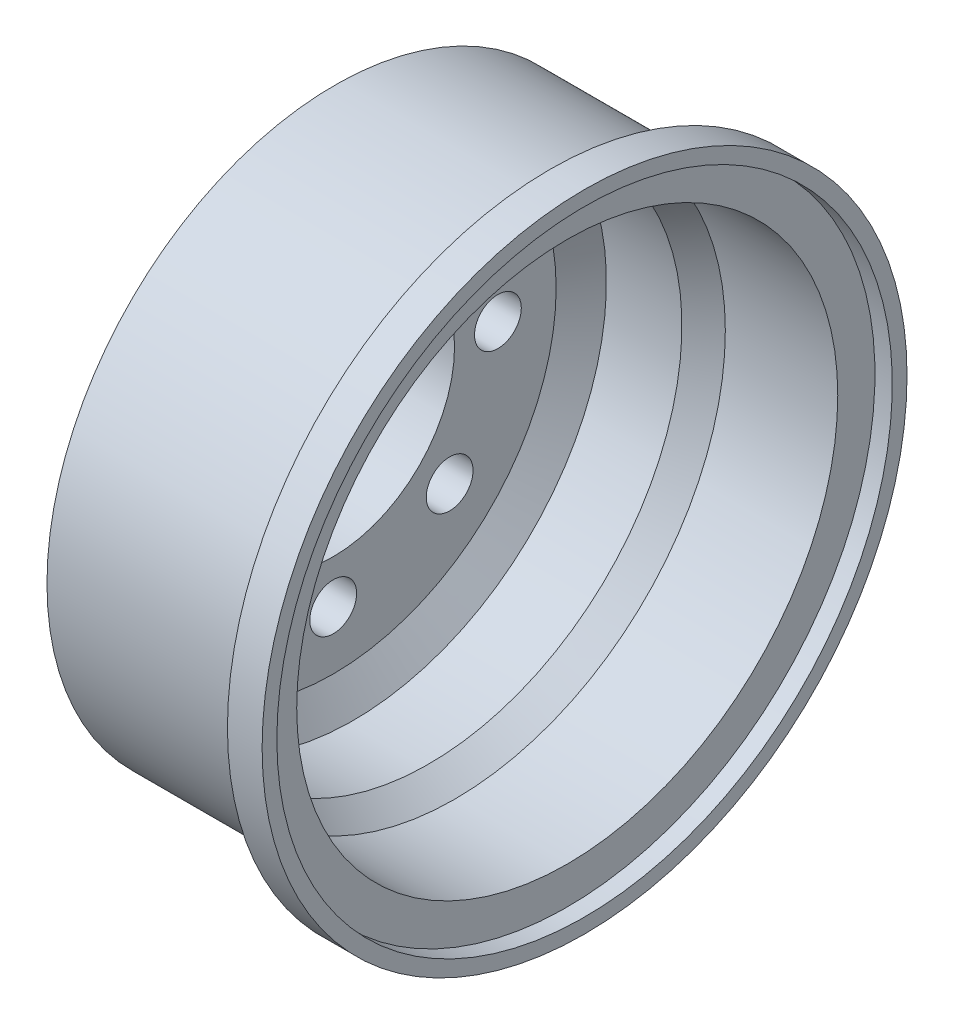
ISO-10303-21;
HEADER;
FILE_DESCRIPTION(('STEP AP214'),'2;1');
FILE_NAME('part.step','',(''),(''),'','','');
FILE_SCHEMA(('AUTOMOTIVE_DESIGN { 1 0 10303 214 1 1 1 1 }'));
ENDSEC;
DATA;
#1=APPLICATION_CONTEXT('core data for automotive mechanical design processes');
#2=APPLICATION_PROTOCOL_DEFINITION('international standard','automotive_design',2000,#1);
#3=PRODUCT_CONTEXT('',#1,'mechanical');
#4=PRODUCT('Part','Part','',(#3));
#5=PRODUCT_RELATED_PRODUCT_CATEGORY('part','',(#4));
#6=PRODUCT_DEFINITION_FORMATION('','',#4);
#7=PRODUCT_DEFINITION_CONTEXT('part definition',#1,'design');
#8=PRODUCT_DEFINITION('design','',#6,#7);
#9=PRODUCT_DEFINITION_SHAPE('','',#8);
#10=(LENGTH_UNIT() NAMED_UNIT(*) SI_UNIT(.MILLI.,.METRE.));
#11=(NAMED_UNIT(*) PLANE_ANGLE_UNIT() SI_UNIT($,.RADIAN.));
#12=(NAMED_UNIT(*) SI_UNIT($,.STERADIAN.) SOLID_ANGLE_UNIT());
#13=UNCERTAINTY_MEASURE_WITH_UNIT(LENGTH_MEASURE(1.E-05),#10,'distance_accuracy_value','');
#14=(GEOMETRIC_REPRESENTATION_CONTEXT(3) GLOBAL_UNCERTAINTY_ASSIGNED_CONTEXT((#13)) GLOBAL_UNIT_ASSIGNED_CONTEXT((#10,
#11,#12)) REPRESENTATION_CONTEXT('',''));
#15=CARTESIAN_POINT('',(0.,0.,0.));
#16=DIRECTION('',(0.,0.,1.));
#17=DIRECTION('',(1.,0.,0.));
#18=AXIS2_PLACEMENT_3D('',#15,#16,#17);
#19=CARTESIAN_POINT('',(2.71561884584929,0.,0.));
#20=DIRECTION('',(1.,0.,0.));
#21=DIRECTION('',(0.,0.,-1.));
#22=AXIS2_PLACEMENT_3D('',#19,#20,#21);
#23=CONICAL_SURFACE('',#22,14.6,0.590123359638332);
#24=CARTESIAN_POINT('',(4.21561884584929,0.,0.));
#25=DIRECTION('',(-1.,0.,0.));
#26=DIRECTION('',(0.,0.,1.));
#27=AXIS2_PLACEMENT_3D('',#24,#25,#26);
#28=CIRCLE('',#27,15.6046014841789);
#29=CARTESIAN_POINT('',(4.21561884584929,0.,15.6046014841789));
#30=VERTEX_POINT('',#29);
#31=EDGE_CURVE('E70',#30,#30,#28,.T.);
#32=ORIENTED_EDGE('',*,*,#31,.F.);
#33=EDGE_LOOP('',(#32));
#34=FACE_BOUND('',#33,.T.);
#35=CARTESIAN_POINT('',(2.71561884584929,0.,0.));
#36=DIRECTION('',(-1.,0.,0.));
#37=DIRECTION('',(0.,0.,1.));
#38=AXIS2_PLACEMENT_3D('',#35,#36,#37);
#39=CIRCLE('',#38,14.6);
#40=CARTESIAN_POINT('',(2.71561884584929,0.,14.6));
#41=VERTEX_POINT('',#40);
#42=EDGE_CURVE('E10',#41,#41,#39,.T.);
#43=ORIENTED_EDGE('',*,*,#42,.T.);
#44=EDGE_LOOP('',(#43));
#45=FACE_BOUND('',#44,.T.);
#46=ADVANCED_FACE('F31',(#34,#45),#23,.F.);
#47=CARTESIAN_POINT('',(-25.,0.,0.));
#48=DIRECTION('',(-1.,0.,0.));
#49=DIRECTION('',(0.,0.,1.));
#50=AXIS2_PLACEMENT_3D('',#47,#48,#49);
#51=CYLINDRICAL_SURFACE('',#50,14.6);
#52=ORIENTED_EDGE('',*,*,#42,.F.);
#53=EDGE_LOOP('',(#52));
#54=FACE_BOUND('',#53,.T.);
#55=CARTESIAN_POINT('',(-1.63826352647171,0.,0.));
#56=DIRECTION('',(-1.,0.,0.));
#57=DIRECTION('',(0.,0.,1.));
#58=AXIS2_PLACEMENT_3D('',#55,#56,#57);
#59=CIRCLE('',#58,14.6);
#60=CARTESIAN_POINT('',(-1.63826352647171,0.,14.6));
#61=VERTEX_POINT('',#60);
#62=EDGE_CURVE('E38',#61,#61,#59,.T.);
#63=ORIENTED_EDGE('',*,*,#62,.T.);
#64=EDGE_LOOP('',(#63));
#65=FACE_BOUND('',#64,.T.);
#66=ADVANCED_FACE('F187',(#54,#65),#51,.F.);
#67=CARTESIAN_POINT('',(-2.79809650389222,0.,0.));
#68=DIRECTION('',(1.,0.,0.));
#69=DIRECTION('',(0.,0.,-1.));
#70=AXIS2_PLACEMENT_3D('',#67,#68,#69);
#71=CONICAL_SURFACE('',#70,12.8602505338692,0.982793723247329);
#72=ORIENTED_EDGE('',*,*,#62,.F.);
#73=EDGE_LOOP('',(#72));
#74=FACE_BOUND('',#73,.T.);
#75=CARTESIAN_POINT('',(-2.79809650389222,0.,0.));
#76=DIRECTION('',(-1.,0.,0.));
#77=DIRECTION('',(0.,0.,1.));
#78=AXIS2_PLACEMENT_3D('',#75,#76,#77);
#79=CIRCLE('',#78,12.8602505338692);
#80=CARTESIAN_POINT('',(-2.79809650389222,0.,12.8602505338692));
#81=VERTEX_POINT('',#80);
#82=EDGE_CURVE('E43',#81,#81,#79,.T.);
#83=ORIENTED_EDGE('',*,*,#82,.T.);
#84=EDGE_LOOP('',(#83));
#85=FACE_BOUND('',#84,.T.);
#86=ADVANCED_FACE('F113',(#74,#85),#71,.F.);
#87=CARTESIAN_POINT('',(-2.79809650389222,12.8602505338692,0.));
#88=DIRECTION('',(-1.,0.,0.));
#89=DIRECTION('',(0.,0.,1.));
#90=AXIS2_PLACEMENT_3D('',#87,#88,#89);
#91=PLANE('',#90);
#92=CARTESIAN_POINT('',(-2.79809650389222,9.5,0.));
#93=DIRECTION('',(1.,0.,0.));
#94=DIRECTION('',(0.,0.,-1.));
#95=AXIS2_PLACEMENT_3D('',#92,#93,#94);
#96=CIRCLE('',#95,1.35);
#97=CARTESIAN_POINT('',(-2.79809650389222,9.5,-1.35));
#98=VERTEX_POINT('',#97);
#99=EDGE_CURVE('E51',#98,#98,#96,.T.);
#100=ORIENTED_EDGE('',*,*,#99,.F.);
#101=EDGE_LOOP('',(#100));
#102=FACE_BOUND('',#101,.T.);
#103=CARTESIAN_POINT('',(-2.79809650389222,6.71751442127219,-6.71751442127221));
#104=DIRECTION('',(1.,0.,0.));
#105=DIRECTION('',(0.,0.,-1.));
#106=AXIS2_PLACEMENT_3D('',#103,#104,#105);
#107=CIRCLE('',#106,1.35);
#108=CARTESIAN_POINT('',(-2.79809650389222,6.71751442127219,-8.06751442127221));
#109=VERTEX_POINT('',#108);
#110=EDGE_CURVE('E328',#109,#109,#107,.T.);
#111=ORIENTED_EDGE('',*,*,#110,.F.);
#112=EDGE_LOOP('',(#111));
#113=FACE_BOUND('',#112,.T.);
#114=CARTESIAN_POINT('',(-2.79809650389222,2.68261117900053E-13,-9.50000000000027));
#115=DIRECTION('',(1.,0.,0.));
#116=DIRECTION('',(0.,0.,-1.));
#117=AXIS2_PLACEMENT_3D('',#114,#115,#116);
#118=CIRCLE('',#117,1.35);
#119=CARTESIAN_POINT('',(-2.79809650389222,2.68261117900053E-13,-10.8500000000003));
#120=VERTEX_POINT('',#119);
#121=EDGE_CURVE('E331',#120,#120,#118,.T.);
#122=ORIENTED_EDGE('',*,*,#121,.F.);
#123=EDGE_LOOP('',(#122));
#124=FACE_BOUND('',#123,.T.);
#125=CARTESIAN_POINT('',(-2.79809650389222,-6.71751442127201,-6.71751442127266));
#126=DIRECTION('',(1.,0.,0.));
#127=DIRECTION('',(0.,0.,-1.));
#128=AXIS2_PLACEMENT_3D('',#125,#126,#127);
#129=CIRCLE('',#128,1.35);
#130=CARTESIAN_POINT('',(-2.79809650389222,-6.71751442127201,-8.06751442127266));
#131=VERTEX_POINT('',#130);
#132=EDGE_CURVE('E336',#131,#131,#129,.T.);
#133=ORIENTED_EDGE('',*,*,#132,.F.);
#134=EDGE_LOOP('',(#133));
#135=FACE_BOUND('',#134,.T.);
#136=CARTESIAN_POINT('',(-2.79809650389222,-9.5,-5.36522235800106E-13));
#137=DIRECTION('',(1.,0.,0.));
#138=DIRECTION('',(0.,0.,-1.));
#139=AXIS2_PLACEMENT_3D('',#136,#137,#138);
#140=CIRCLE('',#139,1.35);
#141=CARTESIAN_POINT('',(-2.79809650389222,-9.5,-1.35000000000054));
#142=VERTEX_POINT('',#141);
#143=EDGE_CURVE('E339',#142,#142,#140,.T.);
#144=ORIENTED_EDGE('',*,*,#143,.F.);
#145=EDGE_LOOP('',(#144));
#146=FACE_BOUND('',#145,.T.);
#147=CARTESIAN_POINT('',(-2.79809650389222,-6.71751442127239,6.71751442127174));
#148=DIRECTION('',(1.,0.,0.));
#149=DIRECTION('',(0.,0.,-1.));
#150=AXIS2_PLACEMENT_3D('',#147,#148,#149);
#151=CIRCLE('',#150,1.35);
#152=CARTESIAN_POINT('',(-2.79809650389222,-6.71751442127239,5.36751442127174));
#153=VERTEX_POINT('',#152);
#154=EDGE_CURVE('E342',#153,#153,#151,.T.);
#155=ORIENTED_EDGE('',*,*,#154,.F.);
#156=EDGE_LOOP('',(#155));
#157=FACE_BOUND('',#156,.T.);
#158=CARTESIAN_POINT('',(-2.79809650389222,-2.69424532359243E-13,9.49999999999973));
#159=DIRECTION('',(1.,0.,0.));
#160=DIRECTION('',(0.,0.,-1.));
#161=AXIS2_PLACEMENT_3D('',#158,#159,#160);
#162=CIRCLE('',#161,1.35);
#163=CARTESIAN_POINT('',(-2.79809650389222,-2.69424532359243E-13,8.14999999999973));
#164=VERTEX_POINT('',#163);
#165=EDGE_CURVE('E344',#164,#164,#162,.T.);
#166=ORIENTED_EDGE('',*,*,#165,.F.);
#167=EDGE_LOOP('',(#166));
#168=FACE_BOUND('',#167,.T.);
#169=CARTESIAN_POINT('',(-2.79809650389222,6.71751442127201,6.71751442127213));
#170=DIRECTION('',(1.,0.,0.));
#171=DIRECTION('',(0.,0.,-1.));
#172=AXIS2_PLACEMENT_3D('',#169,#170,#171);
#173=CIRCLE('',#172,1.35);
#174=CARTESIAN_POINT('',(-2.79809650389222,6.71751442127201,5.36751442127213));
#175=VERTEX_POINT('',#174);
#176=EDGE_CURVE('E82',#175,#175,#173,.T.);
#177=ORIENTED_EDGE('',*,*,#176,.F.);
#178=EDGE_LOOP('',(#177));
#179=FACE_BOUND('',#178,.T.);
#180=ORIENTED_EDGE('',*,*,#82,.F.);
#181=EDGE_LOOP('',(#180));
#182=FACE_BOUND('',#181,.T.);
#183=CARTESIAN_POINT('',(-2.79809650389222,0.,0.));
#184=DIRECTION('',(-1.,0.,0.));
#185=DIRECTION('',(0.,0.,1.));
#186=AXIS2_PLACEMENT_3D('',#183,#184,#185);
#187=CIRCLE('',#186,7.);
#188=CARTESIAN_POINT('',(-2.79809650389222,0.,7.));
#189=VERTEX_POINT('',#188);
#190=EDGE_CURVE('E108',#189,#189,#187,.T.);
#191=ORIENTED_EDGE('',*,*,#190,.T.);
#192=EDGE_LOOP('',(#191));
#193=FACE_BOUND('',#192,.T.);
#194=ADVANCED_FACE('F115',(#102,#113,#124,#135,#146,#157,#168,#179,#182,#193),#91,.F.);
#195=CARTESIAN_POINT('',(-25.,0.,0.));
#196=DIRECTION('',(-1.,0.,0.));
#197=DIRECTION('',(0.,0.,1.));
#198=AXIS2_PLACEMENT_3D('',#195,#196,#197);
#199=CYLINDRICAL_SURFACE('',#198,7.);
#200=ORIENTED_EDGE('',*,*,#190,.F.);
#201=EDGE_LOOP('',(#200));
#202=FACE_BOUND('',#201,.T.);
#203=CARTESIAN_POINT('',(-5.29809650389222,0.,0.));
#204=DIRECTION('',(-1.,0.,0.));
#205=DIRECTION('',(0.,0.,1.));
#206=AXIS2_PLACEMENT_3D('',#203,#204,#205);
#207=CIRCLE('',#206,7.);
#208=CARTESIAN_POINT('',(-5.29809650389222,0.,7.));
#209=VERTEX_POINT('',#208);
#210=EDGE_CURVE('E105',#209,#209,#207,.T.);
#211=ORIENTED_EDGE('',*,*,#210,.T.);
#212=EDGE_LOOP('',(#211));
#213=FACE_BOUND('',#212,.T.);
#214=ADVANCED_FACE('F118',(#202,#213),#199,.F.);
#215=CARTESIAN_POINT('',(-5.29809650389222,7.,0.));
#216=DIRECTION('',(1.,0.,0.));
#217=DIRECTION('',(0.,0.,-1.));
#218=AXIS2_PLACEMENT_3D('',#215,#216,#217);
#219=PLANE('',#218);
#220=CARTESIAN_POINT('',(-5.29809650389222,9.5,0.));
#221=DIRECTION('',(1.,0.,0.));
#222=DIRECTION('',(0.,0.,-1.));
#223=AXIS2_PLACEMENT_3D('',#220,#221,#222);
#224=CIRCLE('',#223,1.35);
#225=CARTESIAN_POINT('',(-5.29809650389222,9.5,-1.35));
#226=VERTEX_POINT('',#225);
#227=EDGE_CURVE('E34',#226,#226,#224,.T.);
#228=ORIENTED_EDGE('',*,*,#227,.T.);
#229=EDGE_LOOP('',(#228));
#230=FACE_BOUND('',#229,.T.);
#231=CARTESIAN_POINT('',(-5.29809650389222,6.71751442127219,-6.71751442127221));
#232=DIRECTION('',(1.,0.,0.));
#233=DIRECTION('',(0.,0.,-1.));
#234=AXIS2_PLACEMENT_3D('',#231,#232,#233);
#235=CIRCLE('',#234,1.35);
#236=CARTESIAN_POINT('',(-5.29809650389222,6.71751442127219,-8.06751442127221));
#237=VERTEX_POINT('',#236);
#238=EDGE_CURVE('E65',#237,#237,#235,.T.);
#239=ORIENTED_EDGE('',*,*,#238,.T.);
#240=EDGE_LOOP('',(#239));
#241=FACE_BOUND('',#240,.T.);
#242=CARTESIAN_POINT('',(-5.29809650389222,2.68261117900053E-13,-9.50000000000027));
#243=DIRECTION('',(1.,0.,0.));
#244=DIRECTION('',(0.,0.,-1.));
#245=AXIS2_PLACEMENT_3D('',#242,#243,#244);
#246=CIRCLE('',#245,1.35);
#247=CARTESIAN_POINT('',(-5.29809650389222,2.68261117900053E-13,-10.8500000000003));
#248=VERTEX_POINT('',#247);
#249=EDGE_CURVE('E63',#248,#248,#246,.T.);
#250=ORIENTED_EDGE('',*,*,#249,.T.);
#251=EDGE_LOOP('',(#250));
#252=FACE_BOUND('',#251,.T.);
#253=CARTESIAN_POINT('',(-5.29809650389222,-6.71751442127201,-6.71751442127266));
#254=DIRECTION('',(1.,0.,0.));
#255=DIRECTION('',(0.,0.,-1.));
#256=AXIS2_PLACEMENT_3D('',#253,#254,#255);
#257=CIRCLE('',#256,1.35);
#258=CARTESIAN_POINT('',(-5.29809650389222,-6.71751442127201,-8.06751442127266));
#259=VERTEX_POINT('',#258);
#260=EDGE_CURVE('E60',#259,#259,#257,.T.);
#261=ORIENTED_EDGE('',*,*,#260,.T.);
#262=EDGE_LOOP('',(#261));
#263=FACE_BOUND('',#262,.T.);
#264=CARTESIAN_POINT('',(-5.29809650389222,-9.5,-5.36522235800106E-13));
#265=DIRECTION('',(1.,0.,0.));
#266=DIRECTION('',(0.,0.,-1.));
#267=AXIS2_PLACEMENT_3D('',#264,#265,#266);
#268=CIRCLE('',#267,1.35);
#269=CARTESIAN_POINT('',(-5.29809650389222,-9.5,-1.35000000000054));
#270=VERTEX_POINT('',#269);
#271=EDGE_CURVE('E57',#270,#270,#268,.T.);
#272=ORIENTED_EDGE('',*,*,#271,.T.);
#273=EDGE_LOOP('',(#272));
#274=FACE_BOUND('',#273,.T.);
#275=CARTESIAN_POINT('',(-5.29809650389222,-6.71751442127239,6.71751442127174));
#276=DIRECTION('',(1.,0.,0.));
#277=DIRECTION('',(0.,0.,-1.));
#278=AXIS2_PLACEMENT_3D('',#275,#276,#277);
#279=CIRCLE('',#278,1.35);
#280=CARTESIAN_POINT('',(-5.29809650389222,-6.71751442127239,5.36751442127174));
#281=VERTEX_POINT('',#280);
#282=EDGE_CURVE('E54',#281,#281,#279,.T.);
#283=ORIENTED_EDGE('',*,*,#282,.T.);
#284=EDGE_LOOP('',(#283));
#285=FACE_BOUND('',#284,.T.);
#286=CARTESIAN_POINT('',(-5.29809650389222,-2.69424532359243E-13,9.49999999999973));
#287=DIRECTION('',(1.,0.,0.));
#288=DIRECTION('',(0.,0.,-1.));
#289=AXIS2_PLACEMENT_3D('',#286,#287,#288);
#290=CIRCLE('',#289,1.35);
#291=CARTESIAN_POINT('',(-5.29809650389222,-2.69424532359243E-13,8.14999999999973));
#292=VERTEX_POINT('',#291);
#293=EDGE_CURVE('E50',#292,#292,#290,.T.);
#294=ORIENTED_EDGE('',*,*,#293,.T.);
#295=EDGE_LOOP('',(#294));
#296=FACE_BOUND('',#295,.T.);
#297=CARTESIAN_POINT('',(-5.29809650389222,6.71751442127201,6.71751442127213));
#298=DIRECTION('',(1.,0.,0.));
#299=DIRECTION('',(0.,0.,-1.));
#300=AXIS2_PLACEMENT_3D('',#297,#298,#299);
#301=CIRCLE('',#300,1.35);
#302=CARTESIAN_POINT('',(-5.29809650389222,6.71751442127201,5.36751442127213));
#303=VERTEX_POINT('',#302);
#304=EDGE_CURVE('E47',#303,#303,#301,.T.);
#305=ORIENTED_EDGE('',*,*,#304,.T.);
#306=EDGE_LOOP('',(#305));
#307=FACE_BOUND('',#306,.T.);
#308=ORIENTED_EDGE('',*,*,#210,.F.);
#309=EDGE_LOOP('',(#308));
#310=FACE_BOUND('',#309,.T.);
#311=CARTESIAN_POINT('',(-5.29809650389222,0.,0.));
#312=DIRECTION('',(-1.,0.,0.));
#313=DIRECTION('',(0.,0.,1.));
#314=AXIS2_PLACEMENT_3D('',#311,#312,#313);
#315=CIRCLE('',#314,12.7158018093332);
#316=CARTESIAN_POINT('',(-5.29809650389222,0.,12.7158018093332));
#317=VERTEX_POINT('',#316);
#318=EDGE_CURVE('E102',#317,#317,#315,.T.);
#319=ORIENTED_EDGE('',*,*,#318,.T.);
#320=EDGE_LOOP('',(#319));
#321=FACE_BOUND('',#320,.T.);
#322=ADVANCED_FACE('F125',(#230,#241,#252,#263,#274,#285,#296,#307,#310,#321),#219,.F.);
#323=CARTESIAN_POINT('',(-2.7086310434477,0.,0.));
#324=DIRECTION('',(1.,0.,0.));
#325=DIRECTION('',(0.,0.,-1.));
#326=AXIS2_PLACEMENT_3D('',#323,#324,#325);
#327=CONICAL_SURFACE('',#326,16.6,0.982793723247328);
#328=ORIENTED_EDGE('',*,*,#318,.F.);
#329=EDGE_LOOP('',(#328));
#330=FACE_BOUND('',#329,.T.);
#331=CARTESIAN_POINT('',(-2.7086310434477,0.,0.));
#332=DIRECTION('',(-1.,0.,0.));
#333=DIRECTION('',(0.,0.,1.));
#334=AXIS2_PLACEMENT_3D('',#331,#332,#333);
#335=CIRCLE('',#334,16.6);
#336=CARTESIAN_POINT('',(-2.7086310434477,0.,16.6));
#337=VERTEX_POINT('',#336);
#338=EDGE_CURVE('E99',#337,#337,#335,.T.);
#339=ORIENTED_EDGE('',*,*,#338,.T.);
#340=EDGE_LOOP('',(#339));
#341=FACE_BOUND('',#340,.T.);
#342=ADVANCED_FACE('F131',(#330,#341),#327,.T.);
#343=CARTESIAN_POINT('',(-25.,0.,0.));
#344=DIRECTION('',(-1.,0.,0.));
#345=DIRECTION('',(0.,0.,1.));
#346=AXIS2_PLACEMENT_3D('',#343,#344,#345);
#347=CYLINDRICAL_SURFACE('',#346,16.6);
#348=ORIENTED_EDGE('',*,*,#338,.F.);
#349=EDGE_LOOP('',(#348));
#350=FACE_BOUND('',#349,.T.);
#351=CARTESIAN_POINT('',(9.7013689565523,0.,0.));
#352=DIRECTION('',(-1.,0.,0.));
#353=DIRECTION('',(0.,0.,1.));
#354=AXIS2_PLACEMENT_3D('',#351,#352,#353);
#355=CIRCLE('',#354,16.6);
#356=CARTESIAN_POINT('',(9.7013689565523,0.,16.6));
#357=VERTEX_POINT('',#356);
#358=EDGE_CURVE('E96',#357,#357,#355,.T.);
#359=ORIENTED_EDGE('',*,*,#358,.T.);
#360=EDGE_LOOP('',(#359));
#361=FACE_BOUND('',#360,.T.);
#362=ADVANCED_FACE('F137',(#350,#361),#347,.T.);
#363=CARTESIAN_POINT('',(9.7013689565523,16.6,0.));
#364=DIRECTION('',(1.,0.,0.));
#365=DIRECTION('',(0.,0.,-1.));
#366=AXIS2_PLACEMENT_3D('',#363,#364,#365);
#367=PLANE('',#366);
#368=ORIENTED_EDGE('',*,*,#358,.F.);
#369=EDGE_LOOP('',(#368));
#370=FACE_BOUND('',#369,.T.);
#371=CARTESIAN_POINT('',(9.7013689565523,0.,0.));
#372=DIRECTION('',(-1.,0.,0.));
#373=DIRECTION('',(0.,0.,1.));
#374=AXIS2_PLACEMENT_3D('',#371,#372,#373);
#375=CIRCLE('',#374,18.6);
#376=CARTESIAN_POINT('',(9.7013689565523,0.,18.6));
#377=VERTEX_POINT('',#376);
#378=EDGE_CURVE('E93',#377,#377,#375,.T.);
#379=ORIENTED_EDGE('',*,*,#378,.T.);
#380=EDGE_LOOP('',(#379));
#381=FACE_BOUND('',#380,.T.);
#382=ADVANCED_FACE('F143',(#370,#381),#367,.F.);
#383=CARTESIAN_POINT('',(-25.,0.,0.));
#384=DIRECTION('',(-1.,0.,0.));
#385=DIRECTION('',(0.,0.,1.));
#386=AXIS2_PLACEMENT_3D('',#383,#384,#385);
#387=CYLINDRICAL_SURFACE('',#386,18.6);
#388=ORIENTED_EDGE('',*,*,#378,.F.);
#389=EDGE_LOOP('',(#388));
#390=FACE_BOUND('',#389,.T.);
#391=CARTESIAN_POINT('',(11.7013689565523,0.,0.));
#392=DIRECTION('',(-1.,0.,0.));
#393=DIRECTION('',(0.,0.,1.));
#394=AXIS2_PLACEMENT_3D('',#391,#392,#393);
#395=CIRCLE('',#394,18.6);
#396=CARTESIAN_POINT('',(11.7013689565523,0.,18.6));
#397=VERTEX_POINT('',#396);
#398=EDGE_CURVE('E90',#397,#397,#395,.T.);
#399=ORIENTED_EDGE('',*,*,#398,.T.);
#400=EDGE_LOOP('',(#399));
#401=FACE_BOUND('',#400,.T.);
#402=ADVANCED_FACE('F149',(#390,#401),#387,.T.);
#403=CARTESIAN_POINT('',(11.7013689565523,18.6,0.));
#404=DIRECTION('',(-1.,0.,0.));
#405=DIRECTION('',(0.,0.,1.));
#406=AXIS2_PLACEMENT_3D('',#403,#404,#405);
#407=PLANE('',#406);
#408=ORIENTED_EDGE('',*,*,#398,.F.);
#409=EDGE_LOOP('',(#408));
#410=FACE_BOUND('',#409,.T.);
#411=CARTESIAN_POINT('',(11.7013689565523,0.,0.));
#412=DIRECTION('',(-1.,0.,0.));
#413=DIRECTION('',(0.,0.,1.));
#414=AXIS2_PLACEMENT_3D('',#411,#412,#413);
#415=CIRCLE('',#414,17.75);
#416=CARTESIAN_POINT('',(11.7013689565523,0.,17.75));
#417=VERTEX_POINT('',#416);
#418=EDGE_CURVE('E87',#417,#417,#415,.T.);
#419=ORIENTED_EDGE('',*,*,#418,.T.);
#420=EDGE_LOOP('',(#419));
#421=FACE_BOUND('',#420,.T.);
#422=ADVANCED_FACE('F155',(#410,#421),#407,.F.);
#423=CARTESIAN_POINT('',(-25.,0.,0.));
#424=DIRECTION('',(-1.,0.,0.));
#425=DIRECTION('',(0.,0.,1.));
#426=AXIS2_PLACEMENT_3D('',#423,#424,#425);
#427=CYLINDRICAL_SURFACE('',#426,17.75);
#428=ORIENTED_EDGE('',*,*,#418,.F.);
#429=EDGE_LOOP('',(#428));
#430=FACE_BOUND('',#429,.T.);
#431=CARTESIAN_POINT('',(10.7013689565523,0.,0.));
#432=DIRECTION('',(-1.,0.,0.));
#433=DIRECTION('',(0.,0.,1.));
#434=AXIS2_PLACEMENT_3D('',#431,#432,#433);
#435=CIRCLE('',#434,17.75);
#436=CARTESIAN_POINT('',(10.7013689565523,0.,17.75));
#437=VERTEX_POINT('',#436);
#438=EDGE_CURVE('E79',#437,#437,#435,.T.);
#439=ORIENTED_EDGE('',*,*,#438,.T.);
#440=EDGE_LOOP('',(#439));
#441=FACE_BOUND('',#440,.T.);
#442=ADVANCED_FACE('F161',(#430,#441),#427,.F.);
#443=CARTESIAN_POINT('',(10.7013689565523,17.75,0.));
#444=DIRECTION('',(-1.,0.,0.));
#445=DIRECTION('',(0.,0.,1.));
#446=AXIS2_PLACEMENT_3D('',#443,#444,#445);
#447=PLANE('',#446);
#448=ORIENTED_EDGE('',*,*,#438,.F.);
#449=EDGE_LOOP('',(#448));
#450=FACE_BOUND('',#449,.T.);
#451=CARTESIAN_POINT('',(10.7013689565523,0.,0.));
#452=DIRECTION('',(-1.,0.,0.));
#453=DIRECTION('',(0.,0.,1.));
#454=AXIS2_PLACEMENT_3D('',#451,#452,#453);
#455=CIRCLE('',#454,15.6046014841789);
#456=CARTESIAN_POINT('',(10.7013689565523,0.,15.6046014841789));
#457=VERTEX_POINT('',#456);
#458=EDGE_CURVE('E74',#457,#457,#455,.T.);
#459=ORIENTED_EDGE('',*,*,#458,.T.);
#460=EDGE_LOOP('',(#459));
#461=FACE_BOUND('',#460,.T.);
#462=ADVANCED_FACE('F167',(#450,#461),#447,.F.);
#463=CARTESIAN_POINT('',(-25.,0.,0.));
#464=DIRECTION('',(-1.,0.,0.));
#465=DIRECTION('',(0.,0.,1.));
#466=AXIS2_PLACEMENT_3D('',#463,#464,#465);
#467=CYLINDRICAL_SURFACE('',#466,15.6046014841789);
#468=ORIENTED_EDGE('',*,*,#458,.F.);
#469=EDGE_LOOP('',(#468));
#470=FACE_BOUND('',#469,.T.);
#471=ORIENTED_EDGE('',*,*,#31,.T.);
#472=EDGE_LOOP('',(#471));
#473=FACE_BOUND('',#472,.T.);
#474=ADVANCED_FACE('F173',(#470,#473),#467,.F.);
#475=CARTESIAN_POINT('',(-12.7980965038922,6.71751442127201,6.71751442127213));
#476=DIRECTION('',(1.,0.,0.));
#477=DIRECTION('',(0.,0.,-1.));
#478=AXIS2_PLACEMENT_3D('',#475,#476,#477);
#479=CYLINDRICAL_SURFACE('',#478,1.35);
#480=ORIENTED_EDGE('',*,*,#176,.T.);
#481=EDGE_LOOP('',(#480));
#482=FACE_BOUND('',#481,.T.);
#483=ORIENTED_EDGE('',*,*,#304,.F.);
#484=EDGE_LOOP('',(#483));
#485=FACE_BOUND('',#484,.T.);
#486=ADVANCED_FACE('F178',(#482,#485),#479,.F.);
#487=CARTESIAN_POINT('',(-12.7980965038922,-2.69424532359243E-13,9.49999999999973));
#488=DIRECTION('',(1.,0.,0.));
#489=DIRECTION('',(0.,0.,-1.));
#490=AXIS2_PLACEMENT_3D('',#487,#488,#489);
#491=CYLINDRICAL_SURFACE('',#490,1.35);
#492=ORIENTED_EDGE('',*,*,#165,.T.);
#493=EDGE_LOOP('',(#492));
#494=FACE_BOUND('',#493,.T.);
#495=ORIENTED_EDGE('',*,*,#293,.F.);
#496=EDGE_LOOP('',(#495));
#497=FACE_BOUND('',#496,.T.);
#498=ADVANCED_FACE('F183',(#494,#497),#491,.F.);
#499=CARTESIAN_POINT('',(-12.7980965038922,-6.71751442127239,6.71751442127174));
#500=DIRECTION('',(1.,0.,0.));
#501=DIRECTION('',(0.,0.,-1.));
#502=AXIS2_PLACEMENT_3D('',#499,#500,#501);
#503=CYLINDRICAL_SURFACE('',#502,1.35);
#504=ORIENTED_EDGE('',*,*,#154,.T.);
#505=EDGE_LOOP('',(#504));
#506=FACE_BOUND('',#505,.T.);
#507=ORIENTED_EDGE('',*,*,#282,.F.);
#508=EDGE_LOOP('',(#507));
#509=FACE_BOUND('',#508,.T.);
#510=ADVANCED_FACE('F261',(#506,#509),#503,.F.);
#511=CARTESIAN_POINT('',(-12.7980965038922,-9.5,-5.36522235800106E-13));
#512=DIRECTION('',(1.,0.,0.));
#513=DIRECTION('',(0.,0.,-1.));
#514=AXIS2_PLACEMENT_3D('',#511,#512,#513);
#515=CYLINDRICAL_SURFACE('',#514,1.35);
#516=ORIENTED_EDGE('',*,*,#143,.T.);
#517=EDGE_LOOP('',(#516));
#518=FACE_BOUND('',#517,.T.);
#519=ORIENTED_EDGE('',*,*,#271,.F.);
#520=EDGE_LOOP('',(#519));
#521=FACE_BOUND('',#520,.T.);
#522=ADVANCED_FACE('F270',(#518,#521),#515,.F.);
#523=CARTESIAN_POINT('',(-12.7980965038922,-6.71751442127201,-6.71751442127266));
#524=DIRECTION('',(1.,0.,0.));
#525=DIRECTION('',(0.,0.,-1.));
#526=AXIS2_PLACEMENT_3D('',#523,#524,#525);
#527=CYLINDRICAL_SURFACE('',#526,1.35);
#528=ORIENTED_EDGE('',*,*,#132,.T.);
#529=EDGE_LOOP('',(#528));
#530=FACE_BOUND('',#529,.T.);
#531=ORIENTED_EDGE('',*,*,#260,.F.);
#532=EDGE_LOOP('',(#531));
#533=FACE_BOUND('',#532,.T.);
#534=ADVANCED_FACE('F279',(#530,#533),#527,.F.);
#535=CARTESIAN_POINT('',(-12.7980965038922,2.68261117900053E-13,-9.50000000000027));
#536=DIRECTION('',(1.,0.,0.));
#537=DIRECTION('',(0.,0.,-1.));
#538=AXIS2_PLACEMENT_3D('',#535,#536,#537);
#539=CYLINDRICAL_SURFACE('',#538,1.35);
#540=ORIENTED_EDGE('',*,*,#121,.T.);
#541=EDGE_LOOP('',(#540));
#542=FACE_BOUND('',#541,.T.);
#543=ORIENTED_EDGE('',*,*,#249,.F.);
#544=EDGE_LOOP('',(#543));
#545=FACE_BOUND('',#544,.T.);
#546=ADVANCED_FACE('F288',(#542,#545),#539,.F.);
#547=CARTESIAN_POINT('',(-12.7980965038922,6.71751442127219,-6.71751442127221));
#548=DIRECTION('',(1.,0.,0.));
#549=DIRECTION('',(0.,0.,-1.));
#550=AXIS2_PLACEMENT_3D('',#547,#548,#549);
#551=CYLINDRICAL_SURFACE('',#550,1.35);
#552=ORIENTED_EDGE('',*,*,#110,.T.);
#553=EDGE_LOOP('',(#552));
#554=FACE_BOUND('',#553,.T.);
#555=ORIENTED_EDGE('',*,*,#238,.F.);
#556=EDGE_LOOP('',(#555));
#557=FACE_BOUND('',#556,.T.);
#558=ADVANCED_FACE('F297',(#554,#557),#551,.F.);
#559=CARTESIAN_POINT('',(-12.7980965038922,9.5,0.));
#560=DIRECTION('',(1.,0.,0.));
#561=DIRECTION('',(0.,0.,-1.));
#562=AXIS2_PLACEMENT_3D('',#559,#560,#561);
#563=CYLINDRICAL_SURFACE('',#562,1.35);
#564=ORIENTED_EDGE('',*,*,#99,.T.);
#565=EDGE_LOOP('',(#564));
#566=FACE_BOUND('',#565,.T.);
#567=ORIENTED_EDGE('',*,*,#227,.F.);
#568=EDGE_LOOP('',(#567));
#569=FACE_BOUND('',#568,.T.);
#570=ADVANCED_FACE('F306',(#566,#569),#563,.F.);
#571=CLOSED_SHELL('',(#46,#66,#86,#194,#214,#322,#342,#362,#382,#402,#422,#442,#462,#474,#486,
#498,#510,#522,#534,#546,#558,#570));
#572=MANIFOLD_SOLID_BREP('B2',#571);
#573=ADVANCED_BREP_SHAPE_REPRESENTATION('',(#18,#572),#14);
#574=SHAPE_DEFINITION_REPRESENTATION(#9,#573);
ENDSEC;
END-ISO-10303-21;
